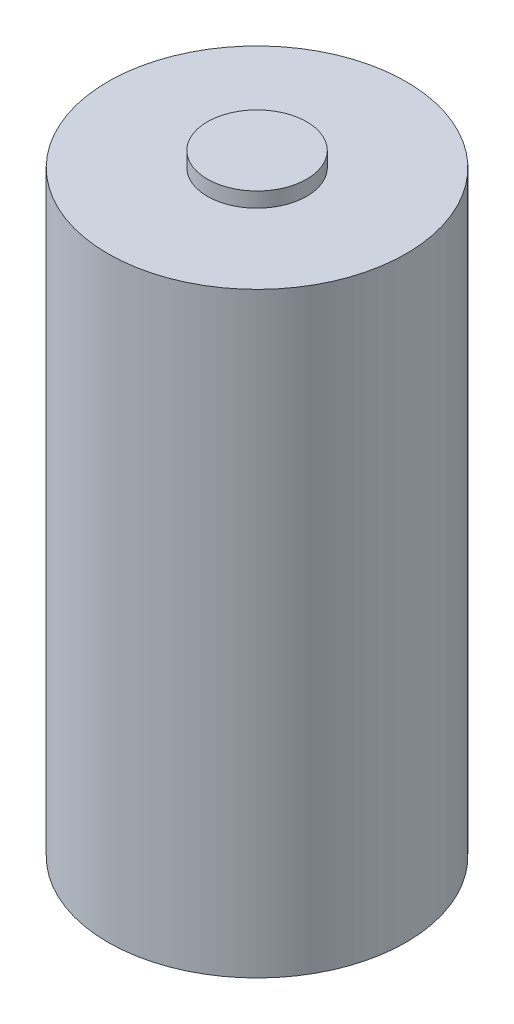
ISO-10303-21;
HEADER;
FILE_DESCRIPTION(('STEP AP214'),'2;1');
FILE_NAME('part.step','',(''),(''),'','','');
FILE_SCHEMA(('AUTOMOTIVE_DESIGN { 1 0 10303 214 1 1 1 1 }'));
ENDSEC;
DATA;
#1=APPLICATION_CONTEXT('core data for automotive mechanical design processes');
#2=APPLICATION_PROTOCOL_DEFINITION('international standard','automotive_design',2000,#1);
#3=PRODUCT_CONTEXT('',#1,'mechanical');
#4=PRODUCT('Part','Part','',(#3));
#5=PRODUCT_RELATED_PRODUCT_CATEGORY('part','',(#4));
#6=PRODUCT_DEFINITION_FORMATION('','',#4);
#7=PRODUCT_DEFINITION_CONTEXT('part definition',#1,'design');
#8=PRODUCT_DEFINITION('design','',#6,#7);
#9=PRODUCT_DEFINITION_SHAPE('','',#8);
#10=(LENGTH_UNIT() NAMED_UNIT(*) SI_UNIT(.MILLI.,.METRE.));
#11=(NAMED_UNIT(*) PLANE_ANGLE_UNIT() SI_UNIT($,.RADIAN.));
#12=(NAMED_UNIT(*) SI_UNIT($,.STERADIAN.) SOLID_ANGLE_UNIT());
#13=UNCERTAINTY_MEASURE_WITH_UNIT(LENGTH_MEASURE(1.E-05),#10,'distance_accuracy_value','');
#14=(GEOMETRIC_REPRESENTATION_CONTEXT(3) GLOBAL_UNCERTAINTY_ASSIGNED_CONTEXT((#13)) GLOBAL_UNIT_ASSIGNED_CONTEXT((#10,
#11,#12)) REPRESENTATION_CONTEXT('',''));
#15=CARTESIAN_POINT('',(0.,0.,0.));
#16=DIRECTION('',(0.,0.,1.));
#17=DIRECTION('',(1.,0.,0.));
#18=AXIS2_PLACEMENT_3D('',#15,#16,#17);
#19=CARTESIAN_POINT('',(0.,12.,0.));
#20=DIRECTION('',(0.,-1.,0.));
#21=DIRECTION('',(0.,0.,-1.));
#22=AXIS2_PLACEMENT_3D('',#19,#20,#21);
#23=CYLINDRICAL_SURFACE('',#22,3.);
#24=CARTESIAN_POINT('',(0.,12.,0.));
#25=DIRECTION('',(0.,1.,0.));
#26=DIRECTION('',(0.,0.,1.));
#27=AXIS2_PLACEMENT_3D('',#24,#25,#26);
#28=CIRCLE('',#27,3.);
#29=CARTESIAN_POINT('',(0.,12.,3.));
#30=VERTEX_POINT('',#29);
#31=EDGE_CURVE('E10',#30,#30,#28,.T.);
#32=ORIENTED_EDGE('',*,*,#31,.F.);
#33=EDGE_LOOP('',(#32));
#34=FACE_BOUND('',#33,.T.);
#35=CARTESIAN_POINT('',(0.,0.,0.));
#36=DIRECTION('',(0.,1.,0.));
#37=DIRECTION('',(0.,0.,1.));
#38=AXIS2_PLACEMENT_3D('',#35,#36,#37);
#39=CIRCLE('',#38,3.);
#40=CARTESIAN_POINT('',(0.,0.,3.));
#41=VERTEX_POINT('',#40);
#42=EDGE_CURVE('E35',#41,#41,#39,.T.);
#43=ORIENTED_EDGE('',*,*,#42,.T.);
#44=EDGE_LOOP('',(#43));
#45=FACE_BOUND('',#44,.T.);
#46=ADVANCED_FACE('F32',(#34,#45),#23,.T.);
#47=CARTESIAN_POINT('',(0.,12.,0.));
#48=DIRECTION('',(0.,1.,0.));
#49=DIRECTION('',(0.,0.,1.));
#50=AXIS2_PLACEMENT_3D('',#47,#48,#49);
#51=PLANE('',#50);
#52=CARTESIAN_POINT('',(0.,12.,0.));
#53=DIRECTION('',(0.,1.,0.));
#54=DIRECTION('',(0.,0.,1.));
#55=AXIS2_PLACEMENT_3D('',#52,#53,#54);
#56=CIRCLE('',#55,1.);
#57=CARTESIAN_POINT('',(0.,12.,1.));
#58=VERTEX_POINT('',#57);
#59=EDGE_CURVE('E44',#58,#58,#56,.T.);
#60=ORIENTED_EDGE('',*,*,#59,.F.);
#61=EDGE_LOOP('',(#60));
#62=FACE_BOUND('',#61,.T.);
#63=ORIENTED_EDGE('',*,*,#31,.T.);
#64=EDGE_LOOP('',(#63));
#65=FACE_BOUND('',#64,.T.);
#66=ADVANCED_FACE('F75',(#62,#65),#51,.T.);
#67=CARTESIAN_POINT('',(0.,0.,0.));
#68=DIRECTION('',(0.,1.,0.));
#69=DIRECTION('',(0.,0.,1.));
#70=AXIS2_PLACEMENT_3D('',#67,#68,#69);
#71=PLANE('',#70);
#72=CARTESIAN_POINT('',(0.,0.,2.));
#73=DIRECTION('',(0.,-1.,0.));
#74=DIRECTION('',(0.,0.,-1.));
#75=AXIS2_PLACEMENT_3D('',#72,#73,#74);
#76=CIRCLE('',#75,0.25);
#77=CARTESIAN_POINT('',(0.,0.,1.75));
#78=VERTEX_POINT('',#77);
#79=EDGE_CURVE('E56',#78,#78,#76,.T.);
#80=ORIENTED_EDGE('',*,*,#79,.F.);
#81=EDGE_LOOP('',(#80));
#82=FACE_BOUND('',#81,.T.);
#83=CARTESIAN_POINT('',(0.,0.,-2.));
#84=DIRECTION('',(0.,-1.,0.));
#85=DIRECTION('',(0.,0.,-1.));
#86=AXIS2_PLACEMENT_3D('',#83,#84,#85);
#87=CIRCLE('',#86,0.25);
#88=CARTESIAN_POINT('',(0.,0.,-2.25));
#89=VERTEX_POINT('',#88);
#90=EDGE_CURVE('E50',#89,#89,#87,.T.);
#91=ORIENTED_EDGE('',*,*,#90,.F.);
#92=EDGE_LOOP('',(#91));
#93=FACE_BOUND('',#92,.T.);
#94=ORIENTED_EDGE('',*,*,#42,.F.);
#95=EDGE_LOOP('',(#94));
#96=FACE_BOUND('',#95,.T.);
#97=ADVANCED_FACE('F71',(#82,#93,#96),#71,.F.);
#98=CARTESIAN_POINT('',(0.,12.3,0.));
#99=DIRECTION('',(0.,-1.,0.));
#100=DIRECTION('',(0.,0.,-1.));
#101=AXIS2_PLACEMENT_3D('',#98,#99,#100);
#102=CYLINDRICAL_SURFACE('',#101,1.);
#103=CARTESIAN_POINT('',(0.,12.3,0.));
#104=DIRECTION('',(0.,1.,0.));
#105=DIRECTION('',(0.,0.,1.));
#106=AXIS2_PLACEMENT_3D('',#103,#104,#105);
#107=CIRCLE('',#106,1.);
#108=CARTESIAN_POINT('',(0.,12.3,1.));
#109=VERTEX_POINT('',#108);
#110=EDGE_CURVE('E42',#109,#109,#107,.T.);
#111=ORIENTED_EDGE('',*,*,#110,.F.);
#112=EDGE_LOOP('',(#111));
#113=FACE_BOUND('',#112,.T.);
#114=ORIENTED_EDGE('',*,*,#59,.T.);
#115=EDGE_LOOP('',(#114));
#116=FACE_BOUND('',#115,.T.);
#117=ADVANCED_FACE('F74',(#113,#116),#102,.T.);
#118=CARTESIAN_POINT('',(0.,12.3,0.));
#119=DIRECTION('',(0.,1.,0.));
#120=DIRECTION('',(0.,0.,1.));
#121=AXIS2_PLACEMENT_3D('',#118,#119,#120);
#122=PLANE('',#121);
#123=ORIENTED_EDGE('',*,*,#110,.T.);
#124=EDGE_LOOP('',(#123));
#125=FACE_BOUND('',#124,.T.);
#126=ADVANCED_FACE('F93',(#125),#122,.T.);
#127=CARTESIAN_POINT('',(0.,0.1,-2.));
#128=DIRECTION('',(0.,-1.,0.));
#129=DIRECTION('',(0.,0.,-1.));
#130=AXIS2_PLACEMENT_3D('',#127,#128,#129);
#131=CYLINDRICAL_SURFACE('',#130,0.25);
#132=CARTESIAN_POINT('',(0.,0.1,-2.));
#133=DIRECTION('',(0.,-1.,0.));
#134=DIRECTION('',(0.,0.,-1.));
#135=AXIS2_PLACEMENT_3D('',#132,#133,#134);
#136=CIRCLE('',#135,0.25);
#137=CARTESIAN_POINT('',(0.,0.1,-2.25));
#138=VERTEX_POINT('',#137);
#139=EDGE_CURVE('E47',#138,#138,#136,.T.);
#140=ORIENTED_EDGE('',*,*,#139,.F.);
#141=EDGE_LOOP('',(#140));
#142=FACE_BOUND('',#141,.T.);
#143=ORIENTED_EDGE('',*,*,#90,.T.);
#144=EDGE_LOOP('',(#143));
#145=FACE_BOUND('',#144,.T.);
#146=ADVANCED_FACE('F97',(#142,#145),#131,.F.);
#147=CARTESIAN_POINT('',(0.,0.1,-2.));
#148=DIRECTION('',(0.,-1.,0.));
#149=DIRECTION('',(0.,0.,-1.));
#150=AXIS2_PLACEMENT_3D('',#147,#148,#149);
#151=PLANE('',#150);
#152=ORIENTED_EDGE('',*,*,#139,.T.);
#153=EDGE_LOOP('',(#152));
#154=FACE_BOUND('',#153,.T.);
#155=ADVANCED_FACE('F67',(#154),#151,.T.);
#156=CARTESIAN_POINT('',(0.,0.1,2.));
#157=DIRECTION('',(0.,-1.,0.));
#158=DIRECTION('',(0.,0.,-1.));
#159=AXIS2_PLACEMENT_3D('',#156,#157,#158);
#160=CYLINDRICAL_SURFACE('',#159,0.25);
#161=CARTESIAN_POINT('',(0.,0.1,2.));
#162=DIRECTION('',(0.,-1.,0.));
#163=DIRECTION('',(0.,0.,-1.));
#164=AXIS2_PLACEMENT_3D('',#161,#162,#163);
#165=CIRCLE('',#164,0.25);
#166=CARTESIAN_POINT('',(0.,0.1,1.75));
#167=VERTEX_POINT('',#166);
#168=EDGE_CURVE('E53',#167,#167,#165,.T.);
#169=ORIENTED_EDGE('',*,*,#168,.F.);
#170=EDGE_LOOP('',(#169));
#171=FACE_BOUND('',#170,.T.);
#172=ORIENTED_EDGE('',*,*,#79,.T.);
#173=EDGE_LOOP('',(#172));
#174=FACE_BOUND('',#173,.T.);
#175=ADVANCED_FACE('F64',(#171,#174),#160,.F.);
#176=CARTESIAN_POINT('',(0.,0.1,2.));
#177=DIRECTION('',(0.,-1.,0.));
#178=DIRECTION('',(0.,0.,-1.));
#179=AXIS2_PLACEMENT_3D('',#176,#177,#178);
#180=PLANE('',#179);
#181=ORIENTED_EDGE('',*,*,#168,.T.);
#182=EDGE_LOOP('',(#181));
#183=FACE_BOUND('',#182,.T.);
#184=ADVANCED_FACE('F62',(#183),#180,.T.);
#185=CLOSED_SHELL('',(#46,#66,#97,#117,#126,#146,#155,#175,#184));
#186=MANIFOLD_SOLID_BREP('B2',#185);
#187=ADVANCED_BREP_SHAPE_REPRESENTATION('',(#18,#186),#14);
#188=SHAPE_DEFINITION_REPRESENTATION(#9,#187);
ENDSEC;
END-ISO-10303-21;
